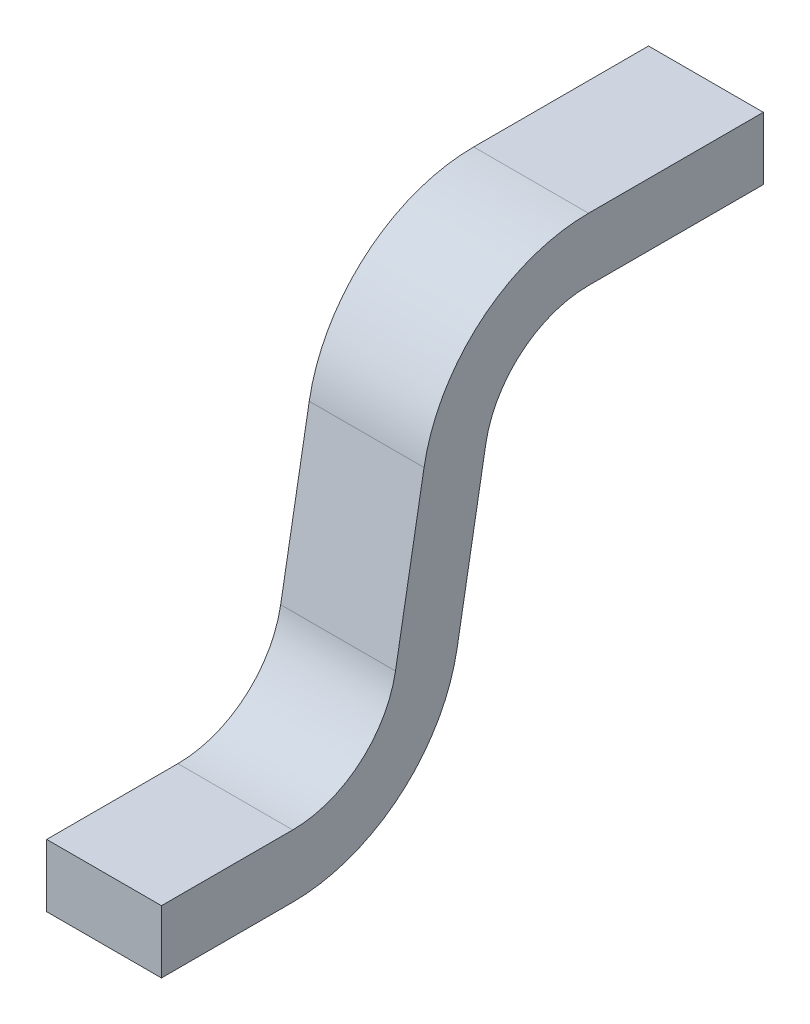
ISO-10303-21;
HEADER;
FILE_DESCRIPTION(('STEP AP214'),'2;1');
FILE_NAME('part.step','',(''),(''),'','','');
FILE_SCHEMA(('AUTOMOTIVE_DESIGN { 1 0 10303 214 1 1 1 1 }'));
ENDSEC;
DATA;
#1=APPLICATION_CONTEXT('core data for automotive mechanical design processes');
#2=APPLICATION_PROTOCOL_DEFINITION('international standard','automotive_design',2000,#1);
#3=PRODUCT_CONTEXT('',#1,'mechanical');
#4=PRODUCT('Part','Part','',(#3));
#5=PRODUCT_RELATED_PRODUCT_CATEGORY('part','',(#4));
#6=PRODUCT_DEFINITION_FORMATION('','',#4);
#7=PRODUCT_DEFINITION_CONTEXT('part definition',#1,'design');
#8=PRODUCT_DEFINITION('design','',#6,#7);
#9=PRODUCT_DEFINITION_SHAPE('','',#8);
#10=(LENGTH_UNIT() NAMED_UNIT(*) SI_UNIT(.MILLI.,.METRE.));
#11=(NAMED_UNIT(*) PLANE_ANGLE_UNIT() SI_UNIT($,.RADIAN.));
#12=(NAMED_UNIT(*) SI_UNIT($,.STERADIAN.) SOLID_ANGLE_UNIT());
#13=UNCERTAINTY_MEASURE_WITH_UNIT(LENGTH_MEASURE(1.E-05),#10,'distance_accuracy_value','');
#14=(GEOMETRIC_REPRESENTATION_CONTEXT(3) GLOBAL_UNCERTAINTY_ASSIGNED_CONTEXT((#13)) GLOBAL_UNIT_ASSIGNED_CONTEXT((#10,
#11,#12)) REPRESENTATION_CONTEXT('',''));
#15=CARTESIAN_POINT('',(0.,0.,0.));
#16=DIRECTION('',(0.,0.,1.));
#17=DIRECTION('',(1.,0.,0.));
#18=AXIS2_PLACEMENT_3D('',#15,#16,#17);
#19=CARTESIAN_POINT('',(0.4191,0.,0.));
#20=DIRECTION('',(1.,0.,0.));
#21=DIRECTION('',(0.,0.,-1.));
#22=AXIS2_PLACEMENT_3D('',#19,#20,#21);
#23=PLANE('',#22);
#24=DIRECTION('',(0.,0.,-1.));
#25=VECTOR('',#24,1.);
#26=CARTESIAN_POINT('',(0.4191,-0.762,1.9812));
#27=LINE('',#26,#25);
#28=CARTESIAN_POINT('',(0.4191,-0.762,1.02303027033135));
#29=VERTEX_POINT('',#28);
#30=CARTESIAN_POINT('',(0.4191,-0.762,1.9812));
#31=VERTEX_POINT('',#30);
#32=EDGE_CURVE('E115',#29,#31,#27,.F.);
#33=ORIENTED_EDGE('',*,*,#32,.F.);
#34=CARTESIAN_POINT('',(0.4191,0.4572,1.02303027033135));
#35=DIRECTION('',(-1.,0.,0.));
#36=DIRECTION('',(0.,0.,1.));
#37=AXIS2_PLACEMENT_3D('',#34,#35,#36);
#38=CIRCLE('',#37,1.2192);
#39=CARTESIAN_POINT('',(0.4191,0.245488141788496,-0.177647342141118));
#40=VERTEX_POINT('',#39);
#41=EDGE_CURVE('E19',#40,#29,#38,.T.);
#42=ORIENTED_EDGE('',*,*,#41,.F.);
#43=DIRECTION('',(0.,0.984807753012213,-0.173648177666902));
#44=VECTOR('',#43,1.);
#45=CARTESIAN_POINT('',(0.4191,-0.762,0.));
#46=LINE('',#45,#44);
#47=CARTESIAN_POINT('',(0.4191,1.42771991138222,-0.386106700571227));
#48=VERTEX_POINT('',#47);
#49=EDGE_CURVE('E100',#48,#40,#46,.F.);
#50=ORIENTED_EDGE('',*,*,#49,.F.);
#51=CARTESIAN_POINT('',(0.4191,1.2954,-1.13653020836658));
#52=DIRECTION('',(1.,0.,0.));
#53=DIRECTION('',(0.,0.,-1.));
#54=AXIS2_PLACEMENT_3D('',#51,#52,#53);
#55=CIRCLE('',#54,0.762);
#56=CARTESIAN_POINT('',(0.4191,2.0574,-1.13653020836658));
#57=VERTEX_POINT('',#56);
#58=EDGE_CURVE('E123',#48,#57,#55,.F.);
#59=ORIENTED_EDGE('',*,*,#58,.T.);
#60=DIRECTION('',(0.,0.,-1.));
#61=VECTOR('',#60,1.);
#62=CARTESIAN_POINT('',(0.4191,2.0574,-1.13653020836658));
#63=LINE('',#62,#61);
#64=CARTESIAN_POINT('',(0.4191,2.0574,-2.413));
#65=VERTEX_POINT('',#64);
#66=EDGE_CURVE('E156',#65,#57,#63,.F.);
#67=ORIENTED_EDGE('',*,*,#66,.F.);
#68=DIRECTION('',(0.,1.,0.));
#69=VECTOR('',#68,1.);
#70=CARTESIAN_POINT('',(0.4191,2.0574,-2.413));
#71=LINE('',#70,#69);
#72=CARTESIAN_POINT('',(0.4191,2.5146,-2.413));
#73=VERTEX_POINT('',#72);
#74=EDGE_CURVE('E151',#73,#65,#71,.F.);
#75=ORIENTED_EDGE('',*,*,#74,.F.);
#76=DIRECTION('',(0.,0.,1.));
#77=VECTOR('',#76,1.);
#78=CARTESIAN_POINT('',(0.4191,2.5146,-2.413));
#79=LINE('',#78,#77);
#80=CARTESIAN_POINT('',(0.4191,2.5146,-1.13653020836658));
#81=VERTEX_POINT('',#80);
#82=EDGE_CURVE('E145',#81,#73,#79,.F.);
#83=ORIENTED_EDGE('',*,*,#82,.F.);
#84=CARTESIAN_POINT('',(0.4191,1.2954,-1.13653020836658));
#85=DIRECTION('',(1.,0.,0.));
#86=DIRECTION('',(0.,0.,-1.));
#87=AXIS2_PLACEMENT_3D('',#84,#85,#86);
#88=CIRCLE('',#87,1.2192);
#89=CARTESIAN_POINT('',(0.4191,1.50711185821147,0.0641474041059478));
#90=VERTEX_POINT('',#89);
#91=EDGE_CURVE('E179',#90,#81,#88,.F.);
#92=ORIENTED_EDGE('',*,*,#91,.F.);
#93=DIRECTION('',(0.,-0.984807753012213,0.173648177666902));
#94=VECTOR('',#93,1.);
#95=CARTESIAN_POINT('',(0.4191,1.50711185821145,0.0641474041059512));
#96=LINE('',#95,#94);
#97=CARTESIAN_POINT('',(0.4191,0.324880088617787,0.272606762536023));
#98=VERTEX_POINT('',#97);
#99=EDGE_CURVE('E141',#98,#90,#96,.F.);
#100=ORIENTED_EDGE('',*,*,#99,.F.);
#101=CARTESIAN_POINT('',(0.4191,0.4572,1.02303027033135));
#102=DIRECTION('',(1.,0.,0.));
#103=DIRECTION('',(0.,0.,-1.));
#104=AXIS2_PLACEMENT_3D('',#101,#102,#103);
#105=CIRCLE('',#104,0.762);
#106=CARTESIAN_POINT('',(0.4191,-0.3048,1.02303027033135));
#107=VERTEX_POINT('',#106);
#108=EDGE_CURVE('E138',#98,#107,#105,.F.);
#109=ORIENTED_EDGE('',*,*,#108,.T.);
#110=DIRECTION('',(0.,0.,1.));
#111=VECTOR('',#110,1.);
#112=CARTESIAN_POINT('',(0.4191,-0.3048,0.383636351374226));
#113=LINE('',#112,#111);
#114=CARTESIAN_POINT('',(0.4191,-0.3048,1.9812));
#115=VERTEX_POINT('',#114);
#116=EDGE_CURVE('E136',#115,#107,#113,.F.);
#117=ORIENTED_EDGE('',*,*,#116,.F.);
#118=DIRECTION('',(0.,1.,0.));
#119=VECTOR('',#118,1.);
#120=CARTESIAN_POINT('',(0.4191,-0.3048,1.9812));
#121=LINE('',#120,#119);
#122=EDGE_CURVE('E131',#31,#115,#121,.T.);
#123=ORIENTED_EDGE('',*,*,#122,.F.);
#124=EDGE_LOOP('',(#33,#42,#50,#59,#67,#75,#83,#92,#100,#109,#117,#123));
#125=FACE_BOUND('',#124,.T.);
#126=ADVANCED_FACE('F16',(#125),#23,.T.);
#127=CARTESIAN_POINT('',(0.427776561405796,0.4572,1.02303027033135));
#128=DIRECTION('',(-1.,0.,0.));
#129=DIRECTION('',(0.,0.,1.));
#130=AXIS2_PLACEMENT_3D('',#127,#128,#129);
#131=CYLINDRICAL_SURFACE('',#130,1.2192);
#132=CARTESIAN_POINT('',(-0.4191,0.4572,1.02303027033135));
#133=DIRECTION('',(-1.,0.,0.));
#134=DIRECTION('',(0.,0.,1.));
#135=AXIS2_PLACEMENT_3D('',#132,#133,#134);
#136=CIRCLE('',#135,1.2192);
#137=CARTESIAN_POINT('',(-0.4191,-0.762,1.02303027033135));
#138=VERTEX_POINT('',#137);
#139=CARTESIAN_POINT('',(-0.4191,0.245488141788509,-0.177647342141142));
#140=VERTEX_POINT('',#139);
#141=EDGE_CURVE('E121',#138,#140,#136,.F.);
#142=ORIENTED_EDGE('',*,*,#141,.T.);
#143=DIRECTION('',(1.,0.,0.));
#144=VECTOR('',#143,1.);
#145=CARTESIAN_POINT('',(-0.4191,0.245488141788477,-0.177647342141114));
#146=LINE('',#145,#144);
#147=EDGE_CURVE('E105',#40,#140,#146,.F.);
#148=ORIENTED_EDGE('',*,*,#147,.F.);
#149=ORIENTED_EDGE('',*,*,#41,.T.);
#150=DIRECTION('',(1.,0.,0.));
#151=VECTOR('',#150,1.);
#152=CARTESIAN_POINT('',(-0.4191,-0.762,1.02303027033135));
#153=LINE('',#152,#151);
#154=EDGE_CURVE('E175',#138,#29,#153,.T.);
#155=ORIENTED_EDGE('',*,*,#154,.F.);
#156=EDGE_LOOP('',(#142,#148,#149,#155));
#157=FACE_BOUND('',#156,.T.);
#158=ADVANCED_FACE('F120',(#157),#131,.T.);
#159=CARTESIAN_POINT('',(-0.4191,-0.762,0.));
#160=DIRECTION('',(0.,-0.173648177666902,-0.984807753012213));
#161=DIRECTION('',(0.,0.984807753012213,-0.173648177666902));
#162=AXIS2_PLACEMENT_3D('',#159,#160,#161);
#163=PLANE('',#162);
#164=ORIENTED_EDGE('',*,*,#49,.T.);
#165=ORIENTED_EDGE('',*,*,#147,.T.);
#166=DIRECTION('',(0.,0.984807753012218,-0.173648177666876));
#167=VECTOR('',#166,1.);
#168=CARTESIAN_POINT('',(-0.4191,0.24548814178847,-0.177647342141156));
#169=LINE('',#168,#167);
#170=CARTESIAN_POINT('',(-0.4191,1.42771991138221,-0.38610670057123));
#171=VERTEX_POINT('',#170);
#172=EDGE_CURVE('E173',#140,#171,#169,.T.);
#173=ORIENTED_EDGE('',*,*,#172,.T.);
#174=DIRECTION('',(1.,0.,0.));
#175=VECTOR('',#174,1.);
#176=CARTESIAN_POINT('',(-0.4191,1.42771991138224,-0.386106700571288));
#177=LINE('',#176,#175);
#178=EDGE_CURVE('E107',#171,#48,#177,.T.);
#179=ORIENTED_EDGE('',*,*,#178,.T.);
#180=EDGE_LOOP('',(#164,#165,#173,#179));
#181=FACE_BOUND('',#180,.T.);
#182=ADVANCED_FACE('F102',(#181),#163,.T.);
#183=CARTESIAN_POINT('',(-0.4191,1.2954,-1.13653020836658));
#184=DIRECTION('',(1.,0.,0.));
#185=DIRECTION('',(0.,0.,-1.));
#186=AXIS2_PLACEMENT_3D('',#183,#184,#185);
#187=CYLINDRICAL_SURFACE('',#186,0.762);
#188=ORIENTED_EDGE('',*,*,#58,.F.);
#189=ORIENTED_EDGE('',*,*,#178,.F.);
#190=CARTESIAN_POINT('',(-0.4191,1.2954,-1.13653020836658));
#191=DIRECTION('',(1.,0.,0.));
#192=DIRECTION('',(0.,0.,-1.));
#193=AXIS2_PLACEMENT_3D('',#190,#191,#192);
#194=CIRCLE('',#193,0.762);
#195=CARTESIAN_POINT('',(-0.4191,2.0574,-1.13653020836658));
#196=VERTEX_POINT('',#195);
#197=EDGE_CURVE('E169',#171,#196,#194,.F.);
#198=ORIENTED_EDGE('',*,*,#197,.T.);
#199=DIRECTION('',(1.,0.,0.));
#200=VECTOR('',#199,1.);
#201=CARTESIAN_POINT('',(-0.4191,2.0574,-1.13653020836658));
#202=LINE('',#201,#200);
#203=EDGE_CURVE('E153',#57,#196,#202,.F.);
#204=ORIENTED_EDGE('',*,*,#203,.F.);
#205=EDGE_LOOP('',(#188,#189,#198,#204));
#206=FACE_BOUND('',#205,.T.);
#207=ADVANCED_FACE('F185',(#206),#187,.F.);
#208=CARTESIAN_POINT('',(-0.4191,2.0574,-1.13653020836658));
#209=DIRECTION('',(0.,-1.,0.));
#210=DIRECTION('',(0.,0.,-1.));
#211=AXIS2_PLACEMENT_3D('',#208,#209,#210);
#212=PLANE('',#211);
#213=ORIENTED_EDGE('',*,*,#203,.T.);
#214=DIRECTION('',(0.,0.,-1.));
#215=VECTOR('',#214,1.);
#216=CARTESIAN_POINT('',(-0.4191,2.0574,0.));
#217=LINE('',#216,#215);
#218=CARTESIAN_POINT('',(-0.4191,2.0574,-2.413));
#219=VERTEX_POINT('',#218);
#220=EDGE_CURVE('E172',#196,#219,#217,.T.);
#221=ORIENTED_EDGE('',*,*,#220,.T.);
#222=DIRECTION('',(-1.,0.,0.));
#223=VECTOR('',#222,1.);
#224=CARTESIAN_POINT('',(-0.4191,2.0574,-2.413));
#225=LINE('',#224,#223);
#226=EDGE_CURVE('E148',#65,#219,#225,.T.);
#227=ORIENTED_EDGE('',*,*,#226,.F.);
#228=ORIENTED_EDGE('',*,*,#66,.T.);
#229=EDGE_LOOP('',(#213,#221,#227,#228));
#230=FACE_BOUND('',#229,.T.);
#231=ADVANCED_FACE('F262',(#230),#212,.T.);
#232=CARTESIAN_POINT('',(-0.4191,2.0574,-2.413));
#233=DIRECTION('',(0.,0.,-1.));
#234=DIRECTION('',(-1.,0.,0.));
#235=AXIS2_PLACEMENT_3D('',#232,#233,#234);
#236=PLANE('',#235);
#237=ORIENTED_EDGE('',*,*,#226,.T.);
#238=DIRECTION('',(0.,1.,0.));
#239=VECTOR('',#238,1.);
#240=CARTESIAN_POINT('',(-0.4191,0.,-2.413));
#241=LINE('',#240,#239);
#242=CARTESIAN_POINT('',(-0.4191,2.5146,-2.413));
#243=VERTEX_POINT('',#242);
#244=EDGE_CURVE('E196',#219,#243,#241,.T.);
#245=ORIENTED_EDGE('',*,*,#244,.T.);
#246=DIRECTION('',(1.,0.,0.));
#247=VECTOR('',#246,1.);
#248=CARTESIAN_POINT('',(-0.4191,2.5146,-2.413));
#249=LINE('',#248,#247);
#250=EDGE_CURVE('E147',#73,#243,#249,.F.);
#251=ORIENTED_EDGE('',*,*,#250,.F.);
#252=ORIENTED_EDGE('',*,*,#74,.T.);
#253=EDGE_LOOP('',(#237,#245,#251,#252));
#254=FACE_BOUND('',#253,.T.);
#255=ADVANCED_FACE('F261',(#254),#236,.T.);
#256=CARTESIAN_POINT('',(-0.4191,2.5146,-2.413));
#257=DIRECTION('',(0.,1.,0.));
#258=DIRECTION('',(0.,0.,1.));
#259=AXIS2_PLACEMENT_3D('',#256,#257,#258);
#260=PLANE('',#259);
#261=ORIENTED_EDGE('',*,*,#250,.T.);
#262=DIRECTION('',(0.,0.,-1.));
#263=VECTOR('',#262,1.);
#264=CARTESIAN_POINT('',(-0.4191,2.5146,0.));
#265=LINE('',#264,#263);
#266=CARTESIAN_POINT('',(-0.4191,2.5146,-1.13653020836658));
#267=VERTEX_POINT('',#266);
#268=EDGE_CURVE('E168',#243,#267,#265,.F.);
#269=ORIENTED_EDGE('',*,*,#268,.T.);
#270=DIRECTION('',(1.,0.,0.));
#271=VECTOR('',#270,1.);
#272=CARTESIAN_POINT('',(-0.4191,2.5146,-1.13653020836658));
#273=LINE('',#272,#271);
#274=EDGE_CURVE('E144',#81,#267,#273,.F.);
#275=ORIENTED_EDGE('',*,*,#274,.F.);
#276=ORIENTED_EDGE('',*,*,#82,.T.);
#277=EDGE_LOOP('',(#261,#269,#275,#276));
#278=FACE_BOUND('',#277,.T.);
#279=ADVANCED_FACE('F257',(#278),#260,.T.);
#280=CARTESIAN_POINT('',(-0.4191,1.2954,-1.13653020836658));
#281=DIRECTION('',(1.,0.,0.));
#282=DIRECTION('',(0.,0.,-1.));
#283=AXIS2_PLACEMENT_3D('',#280,#281,#282);
#284=CYLINDRICAL_SURFACE('',#283,1.2192);
#285=ORIENTED_EDGE('',*,*,#274,.T.);
#286=CARTESIAN_POINT('',(-0.4191,1.2954,-1.13653020836658));
#287=DIRECTION('',(1.,0.,0.));
#288=DIRECTION('',(0.,0.,-1.));
#289=AXIS2_PLACEMENT_3D('',#286,#287,#288);
#290=CIRCLE('',#289,1.2192);
#291=CARTESIAN_POINT('',(-0.4191,1.50711185821145,0.0641474041059517));
#292=VERTEX_POINT('',#291);
#293=EDGE_CURVE('E165',#267,#292,#290,.T.);
#294=ORIENTED_EDGE('',*,*,#293,.T.);
#295=DIRECTION('',(1.,0.,0.));
#296=VECTOR('',#295,1.);
#297=CARTESIAN_POINT('',(-0.4191,1.50711185821145,0.0641474041059512));
#298=LINE('',#297,#296);
#299=EDGE_CURVE('E143',#90,#292,#298,.F.);
#300=ORIENTED_EDGE('',*,*,#299,.F.);
#301=ORIENTED_EDGE('',*,*,#91,.T.);
#302=EDGE_LOOP('',(#285,#294,#300,#301));
#303=FACE_BOUND('',#302,.T.);
#304=ADVANCED_FACE('F253',(#303),#284,.T.);
#305=CARTESIAN_POINT('',(-0.4191,1.50711185821145,0.0641474041059512));
#306=DIRECTION('',(0.,0.173648177666902,0.984807753012213));
#307=DIRECTION('',(0.,-0.984807753012213,0.173648177666902));
#308=AXIS2_PLACEMENT_3D('',#305,#306,#307);
#309=PLANE('',#308);
#310=DIRECTION('',(0.,-0.984807753012219,0.173648177666866));
#311=VECTOR('',#310,1.);
#312=CARTESIAN_POINT('',(-0.4191,1.50711185821145,0.0641474041059512));
#313=LINE('',#312,#311);
#314=CARTESIAN_POINT('',(-0.4191,0.324880088617797,0.272606762535999));
#315=VERTEX_POINT('',#314);
#316=EDGE_CURVE('E164',#292,#315,#313,.T.);
#317=ORIENTED_EDGE('',*,*,#316,.T.);
#318=DIRECTION('',(1.,0.,0.));
#319=VECTOR('',#318,1.);
#320=CARTESIAN_POINT('',(-0.426513669262548,0.324880088617764,0.272606762536058));
#321=LINE('',#320,#319);
#322=EDGE_CURVE('E178',#315,#98,#321,.T.);
#323=ORIENTED_EDGE('',*,*,#322,.T.);
#324=ORIENTED_EDGE('',*,*,#99,.T.);
#325=ORIENTED_EDGE('',*,*,#299,.T.);
#326=EDGE_LOOP('',(#317,#323,#324,#325));
#327=FACE_BOUND('',#326,.T.);
#328=ADVANCED_FACE('F247',(#327),#309,.T.);
#329=CARTESIAN_POINT('',(-0.426513669262548,0.4572,1.02303027033135));
#330=DIRECTION('',(1.,0.,0.));
#331=DIRECTION('',(0.,0.,-1.));
#332=AXIS2_PLACEMENT_3D('',#329,#330,#331);
#333=CYLINDRICAL_SURFACE('',#332,0.762);
#334=ORIENTED_EDGE('',*,*,#322,.F.);
#335=CARTESIAN_POINT('',(-0.4191,0.4572,1.02303027033135));
#336=DIRECTION('',(1.,0.,0.));
#337=DIRECTION('',(0.,0.,-1.));
#338=AXIS2_PLACEMENT_3D('',#335,#336,#337);
#339=CIRCLE('',#338,0.762);
#340=CARTESIAN_POINT('',(-0.4191,-0.3048,1.02303027033135));
#341=VERTEX_POINT('',#340);
#342=EDGE_CURVE('E160',#315,#341,#339,.F.);
#343=ORIENTED_EDGE('',*,*,#342,.T.);
#344=DIRECTION('',(1.,0.,0.));
#345=VECTOR('',#344,1.);
#346=CARTESIAN_POINT('',(-0.4191,-0.3048,1.02303027033135));
#347=LINE('',#346,#345);
#348=EDGE_CURVE('E133',#107,#341,#347,.F.);
#349=ORIENTED_EDGE('',*,*,#348,.F.);
#350=ORIENTED_EDGE('',*,*,#108,.F.);
#351=EDGE_LOOP('',(#334,#343,#349,#350));
#352=FACE_BOUND('',#351,.T.);
#353=ADVANCED_FACE('F244',(#352),#333,.F.);
#354=CARTESIAN_POINT('',(-0.4191,-0.3048,0.383636351374226));
#355=DIRECTION('',(0.,1.,0.));
#356=DIRECTION('',(0.,0.,1.));
#357=AXIS2_PLACEMENT_3D('',#354,#355,#356);
#358=PLANE('',#357);
#359=ORIENTED_EDGE('',*,*,#116,.T.);
#360=ORIENTED_EDGE('',*,*,#348,.T.);
#361=DIRECTION('',(0.,0.,-1.));
#362=VECTOR('',#361,1.);
#363=CARTESIAN_POINT('',(-0.4191,-0.3048,0.));
#364=LINE('',#363,#362);
#365=CARTESIAN_POINT('',(-0.4191,-0.3048,1.9812));
#366=VERTEX_POINT('',#365);
#367=EDGE_CURVE('E163',#341,#366,#364,.F.);
#368=ORIENTED_EDGE('',*,*,#367,.T.);
#369=DIRECTION('',(1.,0.,0.));
#370=VECTOR('',#369,1.);
#371=CARTESIAN_POINT('',(-0.4191,-0.3048,1.9812));
#372=LINE('',#371,#370);
#373=EDGE_CURVE('E128',#115,#366,#372,.F.);
#374=ORIENTED_EDGE('',*,*,#373,.F.);
#375=EDGE_LOOP('',(#359,#360,#368,#374));
#376=FACE_BOUND('',#375,.T.);
#377=ADVANCED_FACE('F236',(#376),#358,.T.);
#378=CARTESIAN_POINT('',(-0.4191,-0.3048,1.9812));
#379=DIRECTION('',(0.,0.,1.));
#380=DIRECTION('',(1.,0.,0.));
#381=AXIS2_PLACEMENT_3D('',#378,#379,#380);
#382=PLANE('',#381);
#383=ORIENTED_EDGE('',*,*,#373,.T.);
#384=DIRECTION('',(0.,1.,0.));
#385=VECTOR('',#384,1.);
#386=CARTESIAN_POINT('',(-0.4191,0.,1.9812));
#387=LINE('',#386,#385);
#388=CARTESIAN_POINT('',(-0.4191,-0.762,1.9812));
#389=VERTEX_POINT('',#388);
#390=EDGE_CURVE('E25',#366,#389,#387,.F.);
#391=ORIENTED_EDGE('',*,*,#390,.T.);
#392=DIRECTION('',(1.,0.,0.));
#393=VECTOR('',#392,1.);
#394=CARTESIAN_POINT('',(-0.4191,-0.762,1.9812));
#395=LINE('',#394,#393);
#396=EDGE_CURVE('E33',#31,#389,#395,.F.);
#397=ORIENTED_EDGE('',*,*,#396,.F.);
#398=ORIENTED_EDGE('',*,*,#122,.T.);
#399=EDGE_LOOP('',(#383,#391,#397,#398));
#400=FACE_BOUND('',#399,.T.);
#401=ADVANCED_FACE('F265',(#400),#382,.T.);
#402=CARTESIAN_POINT('',(-0.4191,-0.762,1.9812));
#403=DIRECTION('',(0.,-1.,0.));
#404=DIRECTION('',(0.,0.,-1.));
#405=AXIS2_PLACEMENT_3D('',#402,#403,#404);
#406=PLANE('',#405);
#407=DIRECTION('',(0.,0.,-1.));
#408=VECTOR('',#407,1.);
#409=CARTESIAN_POINT('',(-0.4191,-0.762,0.));
#410=LINE('',#409,#408);
#411=EDGE_CURVE('E10',#389,#138,#410,.T.);
#412=ORIENTED_EDGE('',*,*,#411,.T.);
#413=ORIENTED_EDGE('',*,*,#154,.T.);
#414=ORIENTED_EDGE('',*,*,#32,.T.);
#415=ORIENTED_EDGE('',*,*,#396,.T.);
#416=EDGE_LOOP('',(#412,#413,#414,#415));
#417=FACE_BOUND('',#416,.T.);
#418=ADVANCED_FACE('F263',(#417),#406,.T.);
#419=CARTESIAN_POINT('',(-0.4191,0.,0.));
#420=DIRECTION('',(1.,0.,0.));
#421=DIRECTION('',(0.,0.,-1.));
#422=AXIS2_PLACEMENT_3D('',#419,#420,#421);
#423=PLANE('',#422);
#424=ORIENTED_EDGE('',*,*,#390,.F.);
#425=ORIENTED_EDGE('',*,*,#367,.F.);
#426=ORIENTED_EDGE('',*,*,#342,.F.);
#427=ORIENTED_EDGE('',*,*,#316,.F.);
#428=ORIENTED_EDGE('',*,*,#293,.F.);
#429=ORIENTED_EDGE('',*,*,#268,.F.);
#430=ORIENTED_EDGE('',*,*,#244,.F.);
#431=ORIENTED_EDGE('',*,*,#220,.F.);
#432=ORIENTED_EDGE('',*,*,#197,.F.);
#433=ORIENTED_EDGE('',*,*,#172,.F.);
#434=ORIENTED_EDGE('',*,*,#141,.F.);
#435=ORIENTED_EDGE('',*,*,#411,.F.);
#436=EDGE_LOOP('',(#424,#425,#426,#427,#428,#429,#430,#431,#432,#433,#434,#435));
#437=FACE_BOUND('',#436,.T.);
#438=ADVANCED_FACE('F241',(#437),#423,.F.);
#439=CLOSED_SHELL('',(#126,#158,#182,#207,#231,#255,#279,#304,#328,#353,#377,#401,#418,#438));
#440=MANIFOLD_SOLID_BREP('B1',#439);
#441=ADVANCED_BREP_SHAPE_REPRESENTATION('',(#18,#440),#14);
#442=SHAPE_DEFINITION_REPRESENTATION(#9,#441);
ENDSEC;
END-ISO-10303-21;
